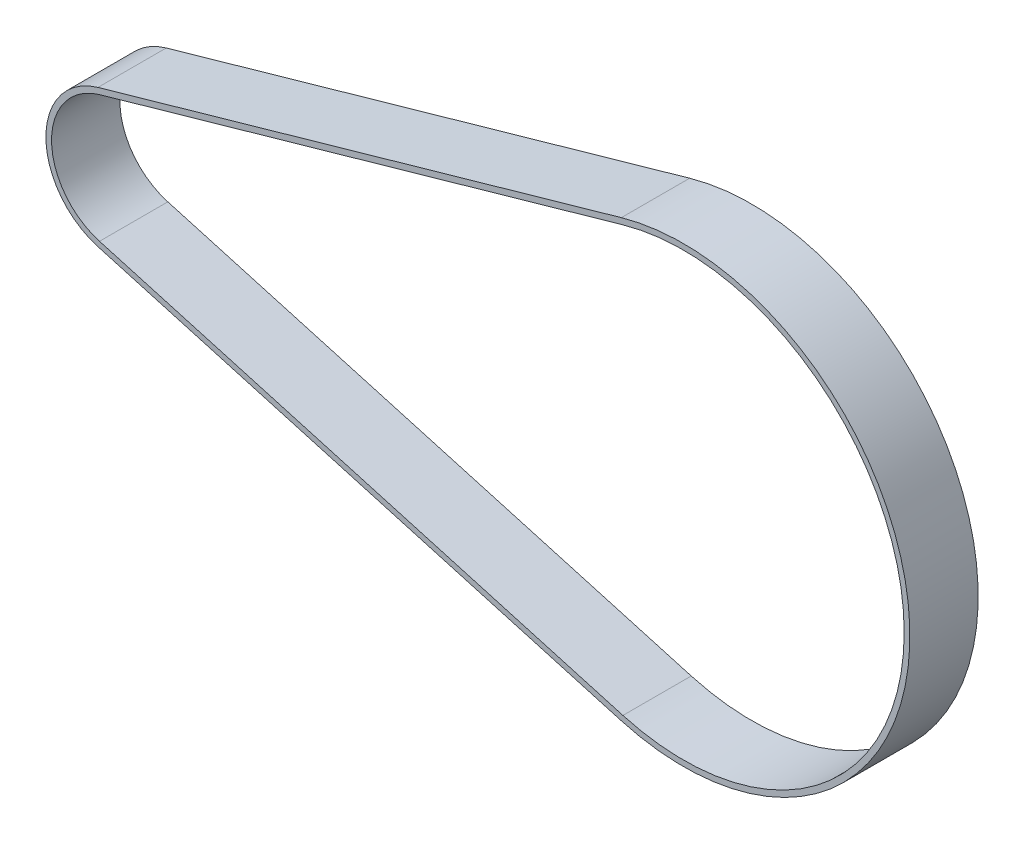
ISO-10303-21;
HEADER;
FILE_DESCRIPTION(('STEP AP214'),'2;1');
FILE_NAME('part.step','',(''),(''),'','','');
FILE_SCHEMA(('AUTOMOTIVE_DESIGN { 1 0 10303 214 1 1 1 1 }'));
ENDSEC;
DATA;
#1=APPLICATION_CONTEXT('core data for automotive mechanical design processes');
#2=APPLICATION_PROTOCOL_DEFINITION('international standard','automotive_design',2000,#1);
#3=PRODUCT_CONTEXT('',#1,'mechanical');
#4=PRODUCT('Part','Part','',(#3));
#5=PRODUCT_RELATED_PRODUCT_CATEGORY('part','',(#4));
#6=PRODUCT_DEFINITION_FORMATION('','',#4);
#7=PRODUCT_DEFINITION_CONTEXT('part definition',#1,'design');
#8=PRODUCT_DEFINITION('design','',#6,#7);
#9=PRODUCT_DEFINITION_SHAPE('','',#8);
#10=(LENGTH_UNIT() NAMED_UNIT(*) SI_UNIT(.MILLI.,.METRE.));
#11=(NAMED_UNIT(*) PLANE_ANGLE_UNIT() SI_UNIT($,.RADIAN.));
#12=(NAMED_UNIT(*) SI_UNIT($,.STERADIAN.) SOLID_ANGLE_UNIT());
#13=UNCERTAINTY_MEASURE_WITH_UNIT(LENGTH_MEASURE(1.E-05),#10,'distance_accuracy_value','');
#14=(GEOMETRIC_REPRESENTATION_CONTEXT(3) GLOBAL_UNCERTAINTY_ASSIGNED_CONTEXT((#13)) GLOBAL_UNIT_ASSIGNED_CONTEXT((#10,
#11,#12)) REPRESENTATION_CONTEXT('',''));
#15=CARTESIAN_POINT('',(0.,0.,0.));
#16=DIRECTION('',(0.,0.,1.));
#17=DIRECTION('',(1.,0.,0.));
#18=AXIS2_PLACEMENT_3D('',#15,#16,#17);
#19=CARTESIAN_POINT('',(49.7,0.,6.));
#20=DIRECTION('',(0.,0.,1.));
#21=DIRECTION('',(1.,0.,0.));
#22=AXIS2_PLACEMENT_3D('',#19,#20,#21);
#23=PLANE('',#22);
#24=CARTESIAN_POINT('',(49.7,0.,6.));
#25=DIRECTION('',(0.,0.,1.));
#26=DIRECTION('',(1.,0.,0.));
#27=AXIS2_PLACEMENT_3D('',#24,#25,#26);
#28=CIRCLE('',#27,19.9);
#29=CARTESIAN_POINT('',(44.2545271629779,-19.1404499837714,6.));
#30=VERTEX_POINT('',#29);
#31=CARTESIAN_POINT('',(44.2545271629779,19.1404499837714,6.));
#32=VERTEX_POINT('',#31);
#33=EDGE_CURVE('E135',#30,#32,#28,.T.);
#34=ORIENTED_EDGE('',*,*,#33,.T.);
#35=DIRECTION('',(-0.961831657475949,-0.27364185110664,0.));
#36=VECTOR('',#35,1.);
#37=CARTESIAN_POINT('',(-1.72394366197183,6.05953944209848,6.));
#38=LINE('',#37,#36);
#39=CARTESIAN_POINT('',(-1.72394366197183,6.05953944209848,6.));
#40=VERTEX_POINT('',#39);
#41=EDGE_CURVE('E138',#32,#40,#38,.T.);
#42=ORIENTED_EDGE('',*,*,#41,.T.);
#43=CARTESIAN_POINT('',(0.,0.,6.));
#44=DIRECTION('',(0.,0.,1.));
#45=DIRECTION('',(1.,0.,0.));
#46=AXIS2_PLACEMENT_3D('',#43,#44,#45);
#47=CIRCLE('',#46,6.3);
#48=CARTESIAN_POINT('',(-1.72394366197183,-6.05953944209848,6.));
#49=VERTEX_POINT('',#48);
#50=EDGE_CURVE('E141',#40,#49,#47,.T.);
#51=ORIENTED_EDGE('',*,*,#50,.T.);
#52=DIRECTION('',(0.961831657475949,-0.27364185110664,0.));
#53=VECTOR('',#52,1.);
#54=CARTESIAN_POINT('',(-1.72394366197183,-6.05953944209848,6.));
#55=LINE('',#54,#53);
#56=EDGE_CURVE('E143',#49,#30,#55,.T.);
#57=ORIENTED_EDGE('',*,*,#56,.T.);
#58=EDGE_LOOP('',(#34,#42,#51,#57));
#59=FACE_BOUND('',#58,.T.);
#60=DIRECTION('',(-0.961831657475949,-0.27364185110664,0.));
#61=VECTOR('',#60,1.);
#62=CARTESIAN_POINT('',(-1.58712273641851,5.57862361336051,6.));
#63=LINE('',#62,#61);
#64=CARTESIAN_POINT('',(44.3913480885312,18.6595341550334,6.));
#65=VERTEX_POINT('',#64);
#66=CARTESIAN_POINT('',(-1.58712273641851,5.57862361336051,6.));
#67=VERTEX_POINT('',#66);
#68=EDGE_CURVE('E107',#65,#67,#63,.T.);
#69=ORIENTED_EDGE('',*,*,#68,.F.);
#70=CARTESIAN_POINT('',(49.7,0.,6.));
#71=DIRECTION('',(0.,0.,1.));
#72=DIRECTION('',(1.,0.,0.));
#73=AXIS2_PLACEMENT_3D('',#70,#71,#72);
#74=CIRCLE('',#73,19.4);
#75=CARTESIAN_POINT('',(44.3913480885312,-18.6595341550334,6.));
#76=VERTEX_POINT('',#75);
#77=EDGE_CURVE('E99',#76,#65,#74,.T.);
#78=ORIENTED_EDGE('',*,*,#77,.F.);
#79=DIRECTION('',(0.961831657475949,-0.27364185110664,0.));
#80=VECTOR('',#79,1.);
#81=CARTESIAN_POINT('',(-1.58712273641851,-5.57862361336051,6.));
#82=LINE('',#81,#80);
#83=CARTESIAN_POINT('',(-1.58712273641851,-5.57862361336051,6.));
#84=VERTEX_POINT('',#83);
#85=EDGE_CURVE('E121',#84,#76,#82,.T.);
#86=ORIENTED_EDGE('',*,*,#85,.F.);
#87=CARTESIAN_POINT('',(0.,0.,6.));
#88=DIRECTION('',(0.,0.,1.));
#89=DIRECTION('',(1.,0.,0.));
#90=AXIS2_PLACEMENT_3D('',#87,#88,#89);
#91=CIRCLE('',#90,5.8);
#92=EDGE_CURVE('E119',#67,#84,#91,.T.);
#93=ORIENTED_EDGE('',*,*,#92,.F.);
#94=EDGE_LOOP('',(#69,#78,#86,#93));
#95=FACE_BOUND('',#94,.T.);
#96=ADVANCED_FACE('F34',(#59,#95),#23,.T.);
#97=CARTESIAN_POINT('',(49.7,0.,0.));
#98=DIRECTION('',(0.,0.,1.));
#99=DIRECTION('',(1.,0.,0.));
#100=AXIS2_PLACEMENT_3D('',#97,#98,#99);
#101=PLANE('',#100);
#102=CARTESIAN_POINT('',(49.7,0.,0.));
#103=DIRECTION('',(0.,0.,1.));
#104=DIRECTION('',(1.,0.,0.));
#105=AXIS2_PLACEMENT_3D('',#102,#103,#104);
#106=CIRCLE('',#105,19.9);
#107=CARTESIAN_POINT('',(44.2545271629779,-19.1404499837714,0.));
#108=VERTEX_POINT('',#107);
#109=CARTESIAN_POINT('',(44.2545271629779,19.1404499837714,0.));
#110=VERTEX_POINT('',#109);
#111=EDGE_CURVE('E115',#108,#110,#106,.T.);
#112=ORIENTED_EDGE('',*,*,#111,.F.);
#113=DIRECTION('',(0.961831657475949,-0.27364185110664,0.));
#114=VECTOR('',#113,1.);
#115=CARTESIAN_POINT('',(-1.72394366197183,-6.05953944209848,0.));
#116=LINE('',#115,#114);
#117=CARTESIAN_POINT('',(-1.72394366197183,-6.05953944209848,0.));
#118=VERTEX_POINT('',#117);
#119=EDGE_CURVE('E139',#118,#108,#116,.T.);
#120=ORIENTED_EDGE('',*,*,#119,.F.);
#121=CARTESIAN_POINT('',(0.,0.,0.));
#122=DIRECTION('',(0.,0.,1.));
#123=DIRECTION('',(1.,0.,0.));
#124=AXIS2_PLACEMENT_3D('',#121,#122,#123);
#125=CIRCLE('',#124,6.3);
#126=CARTESIAN_POINT('',(-1.72394366197183,6.05953944209848,0.));
#127=VERTEX_POINT('',#126);
#128=EDGE_CURVE('E150',#127,#118,#125,.T.);
#129=ORIENTED_EDGE('',*,*,#128,.F.);
#130=DIRECTION('',(-0.961831657475949,-0.27364185110664,0.));
#131=VECTOR('',#130,1.);
#132=CARTESIAN_POINT('',(-1.72394366197183,6.05953944209848,0.));
#133=LINE('',#132,#131);
#134=EDGE_CURVE('E148',#110,#127,#133,.T.);
#135=ORIENTED_EDGE('',*,*,#134,.F.);
#136=EDGE_LOOP('',(#112,#120,#129,#135));
#137=FACE_BOUND('',#136,.T.);
#138=CARTESIAN_POINT('',(49.7,0.,0.));
#139=DIRECTION('',(0.,0.,1.));
#140=DIRECTION('',(1.,0.,0.));
#141=AXIS2_PLACEMENT_3D('',#138,#139,#140);
#142=CIRCLE('',#141,19.4);
#143=CARTESIAN_POINT('',(44.3913480885312,-18.6595341550334,0.));
#144=VERTEX_POINT('',#143);
#145=CARTESIAN_POINT('',(44.3913480885312,18.6595341550334,0.));
#146=VERTEX_POINT('',#145);
#147=EDGE_CURVE('E57',#144,#146,#142,.T.);
#148=ORIENTED_EDGE('',*,*,#147,.T.);
#149=DIRECTION('',(-0.961831657475949,-0.27364185110664,0.));
#150=VECTOR('',#149,1.);
#151=CARTESIAN_POINT('',(-1.58712273641851,5.57862361336051,0.));
#152=LINE('',#151,#150);
#153=CARTESIAN_POINT('',(-1.58712273641851,5.57862361336051,0.));
#154=VERTEX_POINT('',#153);
#155=EDGE_CURVE('E114',#146,#154,#152,.T.);
#156=ORIENTED_EDGE('',*,*,#155,.T.);
#157=CARTESIAN_POINT('',(0.,0.,0.));
#158=DIRECTION('',(0.,0.,1.));
#159=DIRECTION('',(1.,0.,0.));
#160=AXIS2_PLACEMENT_3D('',#157,#158,#159);
#161=CIRCLE('',#160,5.8);
#162=CARTESIAN_POINT('',(-1.58712273641851,-5.57862361336051,0.));
#163=VERTEX_POINT('',#162);
#164=EDGE_CURVE('E127',#154,#163,#161,.T.);
#165=ORIENTED_EDGE('',*,*,#164,.T.);
#166=DIRECTION('',(0.961831657475949,-0.27364185110664,0.));
#167=VECTOR('',#166,1.);
#168=CARTESIAN_POINT('',(-1.58712273641851,-5.57862361336051,0.));
#169=LINE('',#168,#167);
#170=EDGE_CURVE('E108',#163,#144,#169,.T.);
#171=ORIENTED_EDGE('',*,*,#170,.T.);
#172=EDGE_LOOP('',(#148,#156,#165,#171));
#173=FACE_BOUND('',#172,.T.);
#174=ADVANCED_FACE('F168',(#137,#173),#101,.F.);
#175=CARTESIAN_POINT('',(49.7,0.,6.));
#176=DIRECTION('',(0.,0.,-1.));
#177=DIRECTION('',(-1.,0.,0.));
#178=AXIS2_PLACEMENT_3D('',#175,#176,#177);
#179=CYLINDRICAL_SURFACE('',#178,19.9);
#180=ORIENTED_EDGE('',*,*,#111,.T.);
#181=DIRECTION('',(0.,0.,-1.));
#182=VECTOR('',#181,1.);
#183=CARTESIAN_POINT('',(44.2545271629779,19.1404499837714,6.));
#184=LINE('',#183,#182);
#185=EDGE_CURVE('E11',#32,#110,#184,.T.);
#186=ORIENTED_EDGE('',*,*,#185,.F.);
#187=ORIENTED_EDGE('',*,*,#33,.F.);
#188=DIRECTION('',(0.,0.,-1.));
#189=VECTOR('',#188,1.);
#190=CARTESIAN_POINT('',(44.2545271629779,-19.1404499837714,6.));
#191=LINE('',#190,#189);
#192=EDGE_CURVE('E145',#30,#108,#191,.T.);
#193=ORIENTED_EDGE('',*,*,#192,.T.);
#194=EDGE_LOOP('',(#180,#186,#187,#193));
#195=FACE_BOUND('',#194,.T.);
#196=ADVANCED_FACE('F36',(#195),#179,.T.);
#197=CARTESIAN_POINT('',(-1.72394366197183,6.05953944209848,6.));
#198=DIRECTION('',(0.27364185110664,-0.961831657475949,0.));
#199=DIRECTION('',(0.961831657475949,0.27364185110664,0.));
#200=AXIS2_PLACEMENT_3D('',#197,#198,#199);
#201=PLANE('',#200);
#202=ORIENTED_EDGE('',*,*,#134,.T.);
#203=DIRECTION('',(0.,0.,-1.));
#204=VECTOR('',#203,1.);
#205=CARTESIAN_POINT('',(-1.72394366197183,6.05953944209848,6.));
#206=LINE('',#205,#204);
#207=EDGE_CURVE('E42',#40,#127,#206,.T.);
#208=ORIENTED_EDGE('',*,*,#207,.F.);
#209=ORIENTED_EDGE('',*,*,#41,.F.);
#210=ORIENTED_EDGE('',*,*,#185,.T.);
#211=EDGE_LOOP('',(#202,#208,#209,#210));
#212=FACE_BOUND('',#211,.T.);
#213=ADVANCED_FACE('F178',(#212),#201,.F.);
#214=CARTESIAN_POINT('',(0.,0.,6.));
#215=DIRECTION('',(0.,0.,-1.));
#216=DIRECTION('',(-1.,0.,0.));
#217=AXIS2_PLACEMENT_3D('',#214,#215,#216);
#218=CYLINDRICAL_SURFACE('',#217,6.3);
#219=ORIENTED_EDGE('',*,*,#128,.T.);
#220=DIRECTION('',(0.,0.,-1.));
#221=VECTOR('',#220,1.);
#222=CARTESIAN_POINT('',(-1.72394366197183,-6.05953944209848,6.));
#223=LINE('',#222,#221);
#224=EDGE_CURVE('E155',#49,#118,#223,.T.);
#225=ORIENTED_EDGE('',*,*,#224,.F.);
#226=ORIENTED_EDGE('',*,*,#50,.F.);
#227=ORIENTED_EDGE('',*,*,#207,.T.);
#228=EDGE_LOOP('',(#219,#225,#226,#227));
#229=FACE_BOUND('',#228,.T.);
#230=ADVANCED_FACE('F162',(#229),#218,.T.);
#231=CARTESIAN_POINT('',(-1.72394366197183,-6.05953944209848,6.));
#232=DIRECTION('',(0.27364185110664,0.961831657475949,0.));
#233=DIRECTION('',(-0.961831657475949,0.27364185110664,0.));
#234=AXIS2_PLACEMENT_3D('',#231,#232,#233);
#235=PLANE('',#234);
#236=ORIENTED_EDGE('',*,*,#119,.T.);
#237=ORIENTED_EDGE('',*,*,#192,.F.);
#238=ORIENTED_EDGE('',*,*,#56,.F.);
#239=ORIENTED_EDGE('',*,*,#224,.T.);
#240=EDGE_LOOP('',(#236,#237,#238,#239));
#241=FACE_BOUND('',#240,.T.);
#242=ADVANCED_FACE('F172',(#241),#235,.F.);
#243=CARTESIAN_POINT('',(49.7,0.,6.));
#244=DIRECTION('',(0.,0.,-1.));
#245=DIRECTION('',(-1.,0.,0.));
#246=AXIS2_PLACEMENT_3D('',#243,#244,#245);
#247=CYLINDRICAL_SURFACE('',#246,19.4);
#248=ORIENTED_EDGE('',*,*,#147,.F.);
#249=DIRECTION('',(0.,0.,-1.));
#250=VECTOR('',#249,1.);
#251=CARTESIAN_POINT('',(44.3913480885312,-18.6595341550334,6.));
#252=LINE('',#251,#250);
#253=EDGE_CURVE('E103',#76,#144,#252,.T.);
#254=ORIENTED_EDGE('',*,*,#253,.F.);
#255=ORIENTED_EDGE('',*,*,#77,.T.);
#256=DIRECTION('',(0.,0.,-1.));
#257=VECTOR('',#256,1.);
#258=CARTESIAN_POINT('',(44.3913480885312,18.6595341550334,6.));
#259=LINE('',#258,#257);
#260=EDGE_CURVE('E102',#65,#146,#259,.T.);
#261=ORIENTED_EDGE('',*,*,#260,.T.);
#262=EDGE_LOOP('',(#248,#254,#255,#261));
#263=FACE_BOUND('',#262,.T.);
#264=ADVANCED_FACE('F101',(#263),#247,.F.);
#265=CARTESIAN_POINT('',(-1.58712273641851,5.57862361336051,6.));
#266=DIRECTION('',(0.27364185110664,-0.961831657475949,0.));
#267=DIRECTION('',(0.961831657475949,0.27364185110664,0.));
#268=AXIS2_PLACEMENT_3D('',#265,#266,#267);
#269=PLANE('',#268);
#270=ORIENTED_EDGE('',*,*,#155,.F.);
#271=ORIENTED_EDGE('',*,*,#260,.F.);
#272=ORIENTED_EDGE('',*,*,#68,.T.);
#273=DIRECTION('',(0.,0.,-1.));
#274=VECTOR('',#273,1.);
#275=CARTESIAN_POINT('',(-1.58712273641851,5.57862361336051,6.));
#276=LINE('',#275,#274);
#277=EDGE_CURVE('E116',#67,#154,#276,.T.);
#278=ORIENTED_EDGE('',*,*,#277,.T.);
#279=EDGE_LOOP('',(#270,#271,#272,#278));
#280=FACE_BOUND('',#279,.T.);
#281=ADVANCED_FACE('F111',(#280),#269,.T.);
#282=CARTESIAN_POINT('',(0.,0.,6.));
#283=DIRECTION('',(0.,0.,-1.));
#284=DIRECTION('',(-1.,0.,0.));
#285=AXIS2_PLACEMENT_3D('',#282,#283,#284);
#286=CYLINDRICAL_SURFACE('',#285,5.8);
#287=ORIENTED_EDGE('',*,*,#164,.F.);
#288=ORIENTED_EDGE('',*,*,#277,.F.);
#289=ORIENTED_EDGE('',*,*,#92,.T.);
#290=DIRECTION('',(0.,0.,-1.));
#291=VECTOR('',#290,1.);
#292=CARTESIAN_POINT('',(-1.58712273641851,-5.57862361336051,6.));
#293=LINE('',#292,#291);
#294=EDGE_CURVE('E49',#84,#163,#293,.T.);
#295=ORIENTED_EDGE('',*,*,#294,.T.);
#296=EDGE_LOOP('',(#287,#288,#289,#295));
#297=FACE_BOUND('',#296,.T.);
#298=ADVANCED_FACE('F201',(#297),#286,.F.);
#299=CARTESIAN_POINT('',(-1.58712273641851,-5.57862361336051,6.));
#300=DIRECTION('',(0.27364185110664,0.961831657475949,0.));
#301=DIRECTION('',(-0.961831657475949,0.27364185110664,0.));
#302=AXIS2_PLACEMENT_3D('',#299,#300,#301);
#303=PLANE('',#302);
#304=ORIENTED_EDGE('',*,*,#170,.F.);
#305=ORIENTED_EDGE('',*,*,#294,.F.);
#306=ORIENTED_EDGE('',*,*,#85,.T.);
#307=ORIENTED_EDGE('',*,*,#253,.T.);
#308=EDGE_LOOP('',(#304,#305,#306,#307));
#309=FACE_BOUND('',#308,.T.);
#310=ADVANCED_FACE('F205',(#309),#303,.T.);
#311=CLOSED_SHELL('',(#96,#174,#196,#213,#230,#242,#264,#281,#298,#310));
#312=MANIFOLD_SOLID_BREP('B2',#311);
#313=ADVANCED_BREP_SHAPE_REPRESENTATION('',(#18,#312),#14);
#314=SHAPE_DEFINITION_REPRESENTATION(#9,#313);
ENDSEC;
END-ISO-10303-21;
